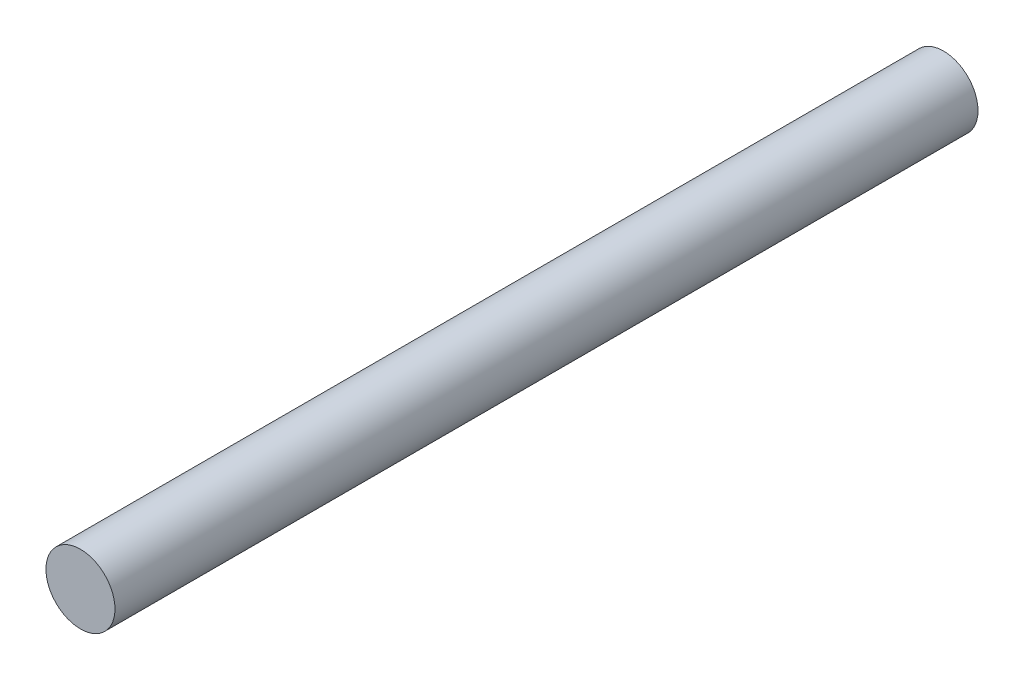
ISO-10303-21;
HEADER;
FILE_DESCRIPTION(('STEP AP214'),'2;1');
FILE_NAME('part.step','',(''),(''),'','','');
FILE_SCHEMA(('AUTOMOTIVE_DESIGN { 1 0 10303 214 1 1 1 1 }'));
ENDSEC;
DATA;
#1=APPLICATION_CONTEXT('core data for automotive mechanical design processes');
#2=APPLICATION_PROTOCOL_DEFINITION('international standard','automotive_design',2000,#1);
#3=PRODUCT_CONTEXT('',#1,'mechanical');
#4=PRODUCT('Part','Part','',(#3));
#5=PRODUCT_RELATED_PRODUCT_CATEGORY('part','',(#4));
#6=PRODUCT_DEFINITION_FORMATION('','',#4);
#7=PRODUCT_DEFINITION_CONTEXT('part definition',#1,'design');
#8=PRODUCT_DEFINITION('design','',#6,#7);
#9=PRODUCT_DEFINITION_SHAPE('','',#8);
#10=(LENGTH_UNIT() NAMED_UNIT(*) SI_UNIT(.MILLI.,.METRE.));
#11=(NAMED_UNIT(*) PLANE_ANGLE_UNIT() SI_UNIT($,.RADIAN.));
#12=(NAMED_UNIT(*) SI_UNIT($,.STERADIAN.) SOLID_ANGLE_UNIT());
#13=UNCERTAINTY_MEASURE_WITH_UNIT(LENGTH_MEASURE(1.E-05),#10,'distance_accuracy_value','');
#14=(GEOMETRIC_REPRESENTATION_CONTEXT(3) GLOBAL_UNCERTAINTY_ASSIGNED_CONTEXT((#13)) GLOBAL_UNIT_ASSIGNED_CONTEXT((#10,
#11,#12)) REPRESENTATION_CONTEXT('',''));
#15=CARTESIAN_POINT('',(0.,0.,0.));
#16=DIRECTION('',(0.,0.,1.));
#17=DIRECTION('',(1.,0.,0.));
#18=AXIS2_PLACEMENT_3D('',#15,#16,#17);
#19=CARTESIAN_POINT('',(0.,0.,100.));
#20=DIRECTION('',(0.,0.,-1.));
#21=DIRECTION('',(-1.,0.,0.));
#22=AXIS2_PLACEMENT_3D('',#19,#20,#21);
#23=CYLINDRICAL_SURFACE('',#22,4.);
#24=CARTESIAN_POINT('',(0.,0.,100.));
#25=DIRECTION('',(0.,0.,1.));
#26=DIRECTION('',(1.,0.,0.));
#27=AXIS2_PLACEMENT_3D('',#24,#25,#26);
#28=CIRCLE('',#27,4.);
#29=CARTESIAN_POINT('',(4.,0.,100.));
#30=VERTEX_POINT('',#29);
#31=EDGE_CURVE('E10',#30,#30,#28,.T.);
#32=ORIENTED_EDGE('',*,*,#31,.F.);
#33=EDGE_LOOP('',(#32));
#34=FACE_BOUND('',#33,.T.);
#35=CARTESIAN_POINT('',(0.,0.,0.));
#36=DIRECTION('',(0.,0.,1.));
#37=DIRECTION('',(1.,0.,0.));
#38=AXIS2_PLACEMENT_3D('',#35,#36,#37);
#39=CIRCLE('',#38,4.);
#40=CARTESIAN_POINT('',(4.,0.,0.));
#41=VERTEX_POINT('',#40);
#42=EDGE_CURVE('E34',#41,#41,#39,.T.);
#43=ORIENTED_EDGE('',*,*,#42,.T.);
#44=EDGE_LOOP('',(#43));
#45=FACE_BOUND('',#44,.T.);
#46=ADVANCED_FACE('F31',(#34,#45),#23,.T.);
#47=CARTESIAN_POINT('',(0.,0.,100.));
#48=DIRECTION('',(0.,0.,1.));
#49=DIRECTION('',(1.,0.,0.));
#50=AXIS2_PLACEMENT_3D('',#47,#48,#49);
#51=PLANE('',#50);
#52=ORIENTED_EDGE('',*,*,#31,.T.);
#53=EDGE_LOOP('',(#52));
#54=FACE_BOUND('',#53,.T.);
#55=ADVANCED_FACE('F46',(#54),#51,.T.);
#56=CARTESIAN_POINT('',(0.,0.,0.));
#57=DIRECTION('',(0.,0.,1.));
#58=DIRECTION('',(1.,0.,0.));
#59=AXIS2_PLACEMENT_3D('',#56,#57,#58);
#60=PLANE('',#59);
#61=ORIENTED_EDGE('',*,*,#42,.F.);
#62=EDGE_LOOP('',(#61));
#63=FACE_BOUND('',#62,.T.);
#64=ADVANCED_FACE('F44',(#63),#60,.F.);
#65=CLOSED_SHELL('',(#46,#55,#64));
#66=MANIFOLD_SOLID_BREP('B2',#65);
#67=ADVANCED_BREP_SHAPE_REPRESENTATION('',(#18,#66),#14);
#68=SHAPE_DEFINITION_REPRESENTATION(#9,#67);
ENDSEC;
END-ISO-10303-21;
